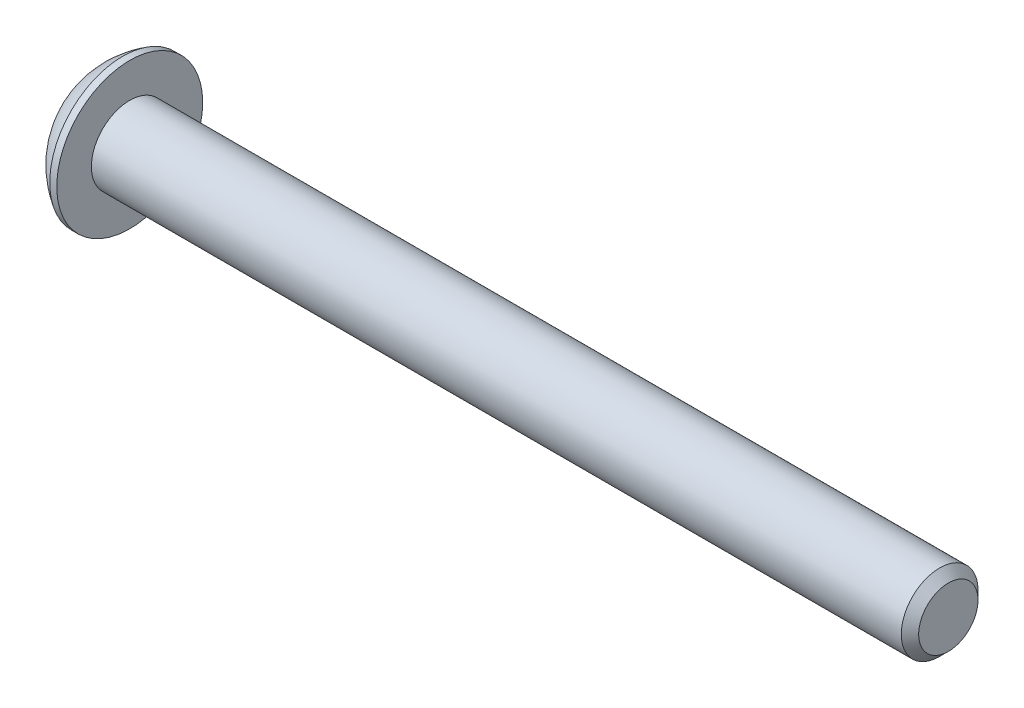
ISO-10303-21;
HEADER;
FILE_DESCRIPTION(('STEP AP214'),'2;1');
FILE_NAME('part.step','',(''),(''),'','','');
FILE_SCHEMA(('AUTOMOTIVE_DESIGN { 1 0 10303 214 1 1 1 1 }'));
ENDSEC;
DATA;
#1=APPLICATION_CONTEXT('core data for automotive mechanical design processes');
#2=APPLICATION_PROTOCOL_DEFINITION('international standard','automotive_design',2000,#1);
#3=PRODUCT_CONTEXT('',#1,'mechanical');
#4=PRODUCT('Part','Part','',(#3));
#5=PRODUCT_RELATED_PRODUCT_CATEGORY('part','',(#4));
#6=PRODUCT_DEFINITION_FORMATION('','',#4);
#7=PRODUCT_DEFINITION_CONTEXT('part definition',#1,'design');
#8=PRODUCT_DEFINITION('design','',#6,#7);
#9=PRODUCT_DEFINITION_SHAPE('','',#8);
#10=(LENGTH_UNIT() NAMED_UNIT(*) SI_UNIT(.MILLI.,.METRE.));
#11=(NAMED_UNIT(*) PLANE_ANGLE_UNIT() SI_UNIT($,.RADIAN.));
#12=(NAMED_UNIT(*) SI_UNIT($,.STERADIAN.) SOLID_ANGLE_UNIT());
#13=UNCERTAINTY_MEASURE_WITH_UNIT(LENGTH_MEASURE(1.E-05),#10,'distance_accuracy_value','');
#14=(GEOMETRIC_REPRESENTATION_CONTEXT(3) GLOBAL_UNCERTAINTY_ASSIGNED_CONTEXT((#13)) GLOBAL_UNIT_ASSIGNED_CONTEXT((#10,
#11,#12)) REPRESENTATION_CONTEXT('',''));
#15=CARTESIAN_POINT('',(0.,0.,0.));
#16=DIRECTION('',(0.,0.,1.));
#17=DIRECTION('',(1.,0.,0.));
#18=AXIS2_PLACEMENT_3D('',#15,#16,#17);
#19=CARTESIAN_POINT('',(1.32080000000034,0.,0.));
#20=DIRECTION('',(-1.,0.,0.));
#21=DIRECTION('',(0.,0.,-1.));
#22=AXIS2_PLACEMENT_3D('',#19,#20,#21);
#23=CONICAL_SURFACE('',#22,1.1937999999998,1.04719755119608);
#24=CARTESIAN_POINT('',(2.01004075135902,0.,-4.44089209850063E-13));
#25=VERTEX_POINT('',#24);
#26=VERTEX_LOOP('',#25);
#27=FACE_BOUND('',#26,.T.);
#28=CARTESIAN_POINT('',(1.32080000000009,0.,0.));
#29=DIRECTION('',(1.,0.,0.));
#30=DIRECTION('',(0.,0.,-1.));
#31=AXIS2_PLACEMENT_3D('',#28,#29,#30);
#32=CIRCLE('',#31,1.19380000000024);
#33=CARTESIAN_POINT('',(1.32080000000004,-1.03386112703797,-0.596900000000061));
#34=VERTEX_POINT('',#33);
#35=CARTESIAN_POINT('',(1.32080000000004,0.,-1.19380000000012));
#36=VERTEX_POINT('',#35);
#37=EDGE_CURVE('E40',#34,#36,#32,.T.);
#38=ORIENTED_EDGE('',*,*,#37,.F.);
#39=CARTESIAN_POINT('',(1.32080000000009,0.,0.));
#40=DIRECTION('',(1.,0.,0.));
#41=DIRECTION('',(0.,0.,-1.));
#42=AXIS2_PLACEMENT_3D('',#39,#40,#41);
#43=CIRCLE('',#42,1.19380000000024);
#44=CARTESIAN_POINT('',(1.32080000000004,-1.03386112703797,0.596900000000061));
#45=VERTEX_POINT('',#44);
#46=EDGE_CURVE('E130',#45,#34,#43,.T.);
#47=ORIENTED_EDGE('',*,*,#46,.F.);
#48=CARTESIAN_POINT('',(1.32080000000009,0.,0.));
#49=DIRECTION('',(1.,0.,0.));
#50=DIRECTION('',(0.,0.,-1.));
#51=AXIS2_PLACEMENT_3D('',#48,#49,#50);
#52=CIRCLE('',#51,1.19380000000024);
#53=CARTESIAN_POINT('',(1.32080000000004,1.49457637585666E-12,1.19380000000012));
#54=VERTEX_POINT('',#53);
#55=EDGE_CURVE('E136',#54,#45,#52,.T.);
#56=ORIENTED_EDGE('',*,*,#55,.F.);
#57=CARTESIAN_POINT('',(1.32080000000009,0.,0.));
#58=DIRECTION('',(1.,0.,0.));
#59=DIRECTION('',(0.,0.,-1.));
#60=AXIS2_PLACEMENT_3D('',#57,#58,#59);
#61=CIRCLE('',#60,1.19380000000024);
#62=CARTESIAN_POINT('',(1.32080000000004,1.03386112703797,0.59690000000006));
#63=VERTEX_POINT('',#62);
#64=EDGE_CURVE('E150',#63,#54,#61,.T.);
#65=ORIENTED_EDGE('',*,*,#64,.F.);
#66=CARTESIAN_POINT('',(1.32080000000009,0.,0.));
#67=DIRECTION('',(1.,0.,0.));
#68=DIRECTION('',(0.,0.,-1.));
#69=AXIS2_PLACEMENT_3D('',#66,#67,#68);
#70=CIRCLE('',#69,1.19380000000024);
#71=CARTESIAN_POINT('',(1.32080000000004,1.03386112703797,-0.59690000000006));
#72=VERTEX_POINT('',#71);
#73=EDGE_CURVE('E143',#72,#63,#70,.T.);
#74=ORIENTED_EDGE('',*,*,#73,.F.);
#75=CARTESIAN_POINT('',(1.32080000000009,0.,0.));
#76=DIRECTION('',(1.,0.,0.));
#77=DIRECTION('',(0.,0.,-1.));
#78=AXIS2_PLACEMENT_3D('',#75,#76,#77);
#79=CIRCLE('',#78,1.19380000000024);
#80=EDGE_CURVE('E140',#36,#72,#79,.T.);
#81=ORIENTED_EDGE('',*,*,#80,.F.);
#82=EDGE_LOOP('',(#38,#47,#56,#65,#74,#81));
#83=FACE_BOUND('',#82,.T.);
#84=ADVANCED_FACE('F37',(#27,#83),#23,.F.);
#85=CARTESIAN_POINT('',(1.3208,-2.06772225407573,1.1938));
#86=DIRECTION('',(1.,0.,0.));
#87=DIRECTION('',(0.,0.,1.));
#88=AXIS2_PLACEMENT_3D('',#85,#86,#87);
#89=PLANE('',#88);
#90=DIRECTION('',(0.,0.5,-0.866025403784439));
#91=VECTOR('',#90,1.);
#92=CARTESIAN_POINT('',(1.3208,-1.37848150271715,0.));
#93=LINE('',#92,#91);
#94=CARTESIAN_POINT('',(1.3208,-0.689240751358575,-1.1938));
#95=VERTEX_POINT('',#94);
#96=EDGE_CURVE('E112',#95,#34,#93,.F.);
#97=ORIENTED_EDGE('',*,*,#96,.T.);
#98=ORIENTED_EDGE('',*,*,#37,.T.);
#99=DIRECTION('',(0.,1.,0.));
#100=VECTOR('',#99,1.);
#101=CARTESIAN_POINT('',(1.3208,-0.689240751358575,-1.1938));
#102=LINE('',#101,#100);
#103=EDGE_CURVE('E127',#36,#95,#102,.F.);
#104=ORIENTED_EDGE('',*,*,#103,.T.);
#105=EDGE_LOOP('',(#97,#98,#104));
#106=FACE_BOUND('',#105,.T.);
#107=ADVANCED_FACE('F124',(#106),#89,.F.);
#108=CARTESIAN_POINT('',(1.3208,-2.06772225407573,1.1938));
#109=DIRECTION('',(1.,0.,0.));
#110=DIRECTION('',(0.,0.,1.));
#111=AXIS2_PLACEMENT_3D('',#108,#109,#110);
#112=PLANE('',#111);
#113=DIRECTION('',(0.,-0.5,-0.866025403784439));
#114=VECTOR('',#113,1.);
#115=CARTESIAN_POINT('',(1.3208,-0.689240751358575,1.1938));
#116=LINE('',#115,#114);
#117=CARTESIAN_POINT('',(1.3208,-1.37848150271715,0.));
#118=VERTEX_POINT('',#117);
#119=EDGE_CURVE('E132',#118,#45,#116,.F.);
#120=ORIENTED_EDGE('',*,*,#119,.T.);
#121=ORIENTED_EDGE('',*,*,#46,.T.);
#122=DIRECTION('',(0.,0.5,-0.866025403784439));
#123=VECTOR('',#122,1.);
#124=CARTESIAN_POINT('',(1.3208,-1.37848150271715,0.));
#125=LINE('',#124,#123);
#126=EDGE_CURVE('E107',#34,#118,#125,.F.);
#127=ORIENTED_EDGE('',*,*,#126,.T.);
#128=EDGE_LOOP('',(#120,#121,#127));
#129=FACE_BOUND('',#128,.T.);
#130=ADVANCED_FACE('F131',(#129),#112,.F.);
#131=CARTESIAN_POINT('',(1.3208,-2.06772225407573,1.1938));
#132=DIRECTION('',(1.,0.,0.));
#133=DIRECTION('',(0.,0.,1.));
#134=AXIS2_PLACEMENT_3D('',#131,#132,#133);
#135=PLANE('',#134);
#136=DIRECTION('',(0.,1.,0.));
#137=VECTOR('',#136,1.);
#138=CARTESIAN_POINT('',(1.3208,0.689240751358575,1.1938));
#139=LINE('',#138,#137);
#140=CARTESIAN_POINT('',(1.3208,-0.689240751358575,1.1938));
#141=VERTEX_POINT('',#140);
#142=EDGE_CURVE('E168',#141,#54,#139,.T.);
#143=ORIENTED_EDGE('',*,*,#142,.T.);
#144=ORIENTED_EDGE('',*,*,#55,.T.);
#145=DIRECTION('',(0.,-0.5,-0.866025403784439));
#146=VECTOR('',#145,1.);
#147=CARTESIAN_POINT('',(1.3208,-0.689240751358575,1.1938));
#148=LINE('',#147,#146);
#149=EDGE_CURVE('E166',#45,#141,#148,.F.);
#150=ORIENTED_EDGE('',*,*,#149,.T.);
#151=EDGE_LOOP('',(#143,#144,#150));
#152=FACE_BOUND('',#151,.T.);
#153=ADVANCED_FACE('F165',(#152),#135,.F.);
#154=CARTESIAN_POINT('',(1.3208,-2.06772225407573,1.1938));
#155=DIRECTION('',(1.,0.,0.));
#156=DIRECTION('',(0.,0.,1.));
#157=AXIS2_PLACEMENT_3D('',#154,#155,#156);
#158=PLANE('',#157);
#159=DIRECTION('',(0.,-0.499999999999999,0.866025403784439));
#160=VECTOR('',#159,1.);
#161=CARTESIAN_POINT('',(1.3208,1.37848150271715,0.));
#162=LINE('',#161,#160);
#163=CARTESIAN_POINT('',(1.3208,0.689240751358575,1.1938));
#164=VERTEX_POINT('',#163);
#165=EDGE_CURVE('E175',#164,#63,#162,.F.);
#166=ORIENTED_EDGE('',*,*,#165,.T.);
#167=ORIENTED_EDGE('',*,*,#64,.T.);
#168=DIRECTION('',(0.,1.,0.));
#169=VECTOR('',#168,1.);
#170=CARTESIAN_POINT('',(1.3208,0.689240751358575,1.1938));
#171=LINE('',#170,#169);
#172=EDGE_CURVE('E173',#54,#164,#171,.T.);
#173=ORIENTED_EDGE('',*,*,#172,.T.);
#174=EDGE_LOOP('',(#166,#167,#173));
#175=FACE_BOUND('',#174,.T.);
#176=ADVANCED_FACE('F172',(#175),#158,.F.);
#177=CARTESIAN_POINT('',(1.3208,-2.06772225407573,1.1938));
#178=DIRECTION('',(1.,0.,0.));
#179=DIRECTION('',(0.,0.,1.));
#180=AXIS2_PLACEMENT_3D('',#177,#178,#179);
#181=PLANE('',#180);
#182=DIRECTION('',(0.,0.499999999999999,0.866025403784439));
#183=VECTOR('',#182,1.);
#184=CARTESIAN_POINT('',(1.3208,0.689240751358575,-1.1938));
#185=LINE('',#184,#183);
#186=CARTESIAN_POINT('',(1.3208,1.37848150271715,0.));
#187=VERTEX_POINT('',#186);
#188=EDGE_CURVE('E186',#187,#72,#185,.F.);
#189=ORIENTED_EDGE('',*,*,#188,.T.);
#190=ORIENTED_EDGE('',*,*,#73,.T.);
#191=DIRECTION('',(0.,-0.499999999999999,0.866025403784439));
#192=VECTOR('',#191,1.);
#193=CARTESIAN_POINT('',(1.3208,1.37848150271715,0.));
#194=LINE('',#193,#192);
#195=EDGE_CURVE('E178',#63,#187,#194,.F.);
#196=ORIENTED_EDGE('',*,*,#195,.T.);
#197=EDGE_LOOP('',(#189,#190,#196));
#198=FACE_BOUND('',#197,.T.);
#199=ADVANCED_FACE('F184',(#198),#181,.F.);
#200=CARTESIAN_POINT('',(1.3208,-2.06772225407573,1.1938));
#201=DIRECTION('',(1.,0.,0.));
#202=DIRECTION('',(0.,0.,1.));
#203=AXIS2_PLACEMENT_3D('',#200,#201,#202);
#204=PLANE('',#203);
#205=DIRECTION('',(0.,1.,0.));
#206=VECTOR('',#205,1.);
#207=CARTESIAN_POINT('',(1.3208,-0.689240751358575,-1.1938));
#208=LINE('',#207,#206);
#209=CARTESIAN_POINT('',(1.3208,0.689240751358575,-1.1938));
#210=VERTEX_POINT('',#209);
#211=EDGE_CURVE('E147',#210,#36,#208,.F.);
#212=ORIENTED_EDGE('',*,*,#211,.T.);
#213=ORIENTED_EDGE('',*,*,#80,.T.);
#214=DIRECTION('',(0.,0.499999999999999,0.866025403784439));
#215=VECTOR('',#214,1.);
#216=CARTESIAN_POINT('',(1.3208,0.689240751358575,-1.1938));
#217=LINE('',#216,#215);
#218=EDGE_CURVE('E188',#72,#210,#217,.F.);
#219=ORIENTED_EDGE('',*,*,#218,.T.);
#220=EDGE_LOOP('',(#212,#213,#219));
#221=FACE_BOUND('',#220,.T.);
#222=ADVANCED_FACE('F309',(#221),#204,.F.);
#223=CARTESIAN_POINT('',(1.3208,-0.689240751358575,-1.1938));
#224=DIRECTION('',(0.,0.,1.));
#225=DIRECTION('',(0.,1.,0.));
#226=AXIS2_PLACEMENT_3D('',#223,#224,#225);
#227=PLANE('',#226);
#228=DIRECTION('',(0.,1.,0.));
#229=VECTOR('',#228,1.);
#230=CARTESIAN_POINT('',(0.,0.,-1.1938));
#231=LINE('',#230,#229);
#232=CARTESIAN_POINT('',(0.,0.689240751358575,-1.1938));
#233=VERTEX_POINT('',#232);
#234=CARTESIAN_POINT('',(0.,-0.689240751358575,-1.1938));
#235=VERTEX_POINT('',#234);
#236=EDGE_CURVE('E196',#233,#235,#231,.F.);
#237=ORIENTED_EDGE('',*,*,#236,.T.);
#238=DIRECTION('',(1.,0.,0.));
#239=VECTOR('',#238,1.);
#240=CARTESIAN_POINT('',(1.3208,-0.689240751358575,-1.1938));
#241=LINE('',#240,#239);
#242=EDGE_CURVE('E119',#235,#95,#241,.T.);
#243=ORIENTED_EDGE('',*,*,#242,.T.);
#244=ORIENTED_EDGE('',*,*,#103,.F.);
#245=ORIENTED_EDGE('',*,*,#211,.F.);
#246=DIRECTION('',(1.,0.,0.));
#247=VECTOR('',#246,1.);
#248=CARTESIAN_POINT('',(1.3208,0.689240751358575,-1.1938));
#249=LINE('',#248,#247);
#250=EDGE_CURVE('E191',#210,#233,#249,.F.);
#251=ORIENTED_EDGE('',*,*,#250,.T.);
#252=EDGE_LOOP('',(#237,#243,#244,#245,#251));
#253=FACE_BOUND('',#252,.T.);
#254=ADVANCED_FACE('F275',(#253),#227,.T.);
#255=CARTESIAN_POINT('',(1.3208,-1.37848150271715,0.));
#256=DIRECTION('',(0.,0.866025403784439,0.5));
#257=DIRECTION('',(0.,0.5,-0.866025403784439));
#258=AXIS2_PLACEMENT_3D('',#255,#256,#257);
#259=PLANE('',#258);
#260=DIRECTION('',(0.,-0.5,0.866025403784439));
#261=VECTOR('',#260,1.);
#262=CARTESIAN_POINT('',(0.,-0.689240751358575,-1.1938));
#263=LINE('',#262,#261);
#264=CARTESIAN_POINT('',(0.,-1.37848150271715,0.));
#265=VERTEX_POINT('',#264);
#266=EDGE_CURVE('E272',#235,#265,#263,.T.);
#267=ORIENTED_EDGE('',*,*,#266,.T.);
#268=DIRECTION('',(1.,0.,0.));
#269=VECTOR('',#268,1.);
#270=CARTESIAN_POINT('',(1.3208,-1.37848150271715,0.));
#271=LINE('',#270,#269);
#272=EDGE_CURVE('E114',#265,#118,#271,.T.);
#273=ORIENTED_EDGE('',*,*,#272,.T.);
#274=ORIENTED_EDGE('',*,*,#126,.F.);
#275=ORIENTED_EDGE('',*,*,#96,.F.);
#276=ORIENTED_EDGE('',*,*,#242,.F.);
#277=EDGE_LOOP('',(#267,#273,#274,#275,#276));
#278=FACE_BOUND('',#277,.T.);
#279=ADVANCED_FACE('F110',(#278),#259,.T.);
#280=CARTESIAN_POINT('',(1.3208,-0.689240751358575,1.1938));
#281=DIRECTION('',(0.,0.866025403784439,-0.5));
#282=DIRECTION('',(0.,-0.5,-0.866025403784439));
#283=AXIS2_PLACEMENT_3D('',#280,#281,#282);
#284=PLANE('',#283);
#285=DIRECTION('',(0.,0.5,0.866025403784439));
#286=VECTOR('',#285,1.);
#287=CARTESIAN_POINT('',(0.,-1.37848150271715,0.));
#288=LINE('',#287,#286);
#289=CARTESIAN_POINT('',(0.,-0.689240751358575,1.1938));
#290=VERTEX_POINT('',#289);
#291=EDGE_CURVE('E270',#265,#290,#288,.T.);
#292=ORIENTED_EDGE('',*,*,#291,.T.);
#293=DIRECTION('',(1.,0.,0.));
#294=VECTOR('',#293,1.);
#295=CARTESIAN_POINT('',(1.3208,-0.689240751358575,1.1938));
#296=LINE('',#295,#294);
#297=EDGE_CURVE('E179',#290,#141,#296,.T.);
#298=ORIENTED_EDGE('',*,*,#297,.T.);
#299=ORIENTED_EDGE('',*,*,#149,.F.);
#300=ORIENTED_EDGE('',*,*,#119,.F.);
#301=ORIENTED_EDGE('',*,*,#272,.F.);
#302=EDGE_LOOP('',(#292,#298,#299,#300,#301));
#303=FACE_BOUND('',#302,.T.);
#304=ADVANCED_FACE('F280',(#303),#284,.T.);
#305=CARTESIAN_POINT('',(1.3208,0.689240751358575,1.1938));
#306=DIRECTION('',(0.,0.,-1.));
#307=DIRECTION('',(1.,0.,0.));
#308=AXIS2_PLACEMENT_3D('',#305,#306,#307);
#309=PLANE('',#308);
#310=DIRECTION('',(0.,1.,0.));
#311=VECTOR('',#310,1.);
#312=CARTESIAN_POINT('',(0.,0.,1.1938));
#313=LINE('',#312,#311);
#314=CARTESIAN_POINT('',(0.,0.689240751358575,1.1938));
#315=VERTEX_POINT('',#314);
#316=EDGE_CURVE('E262',#290,#315,#313,.T.);
#317=ORIENTED_EDGE('',*,*,#316,.T.);
#318=DIRECTION('',(1.,0.,0.));
#319=VECTOR('',#318,1.);
#320=CARTESIAN_POINT('',(1.3208,0.689240751358575,1.1938));
#321=LINE('',#320,#319);
#322=EDGE_CURVE('E189',#315,#164,#321,.T.);
#323=ORIENTED_EDGE('',*,*,#322,.T.);
#324=ORIENTED_EDGE('',*,*,#172,.F.);
#325=ORIENTED_EDGE('',*,*,#142,.F.);
#326=ORIENTED_EDGE('',*,*,#297,.F.);
#327=EDGE_LOOP('',(#317,#323,#324,#325,#326));
#328=FACE_BOUND('',#327,.T.);
#329=ADVANCED_FACE('F282',(#328),#309,.T.);
#330=CARTESIAN_POINT('',(1.3208,1.37848150271715,0.));
#331=DIRECTION('',(0.,-0.866025403784439,-0.499999999999999));
#332=DIRECTION('',(0.,-0.499999999999999,0.866025403784439));
#333=AXIS2_PLACEMENT_3D('',#330,#331,#332);
#334=PLANE('',#333);
#335=DIRECTION('',(0.,0.499999999999999,-0.866025403784439));
#336=VECTOR('',#335,1.);
#337=CARTESIAN_POINT('',(0.,0.689240751358575,1.1938));
#338=LINE('',#337,#336);
#339=CARTESIAN_POINT('',(0.,1.37848150271715,0.));
#340=VERTEX_POINT('',#339);
#341=EDGE_CURVE('E259',#315,#340,#338,.T.);
#342=ORIENTED_EDGE('',*,*,#341,.T.);
#343=DIRECTION('',(1.,0.,0.));
#344=VECTOR('',#343,1.);
#345=CARTESIAN_POINT('',(1.3208,1.37848150271715,0.));
#346=LINE('',#345,#344);
#347=EDGE_CURVE('E204',#340,#187,#346,.T.);
#348=ORIENTED_EDGE('',*,*,#347,.T.);
#349=ORIENTED_EDGE('',*,*,#195,.F.);
#350=ORIENTED_EDGE('',*,*,#165,.F.);
#351=ORIENTED_EDGE('',*,*,#322,.F.);
#352=EDGE_LOOP('',(#342,#348,#349,#350,#351));
#353=FACE_BOUND('',#352,.T.);
#354=ADVANCED_FACE('F283',(#353),#334,.T.);
#355=CARTESIAN_POINT('',(1.3208,0.689240751358575,-1.1938));
#356=DIRECTION('',(0.,-0.866025403784439,0.499999999999999));
#357=DIRECTION('',(0.,0.499999999999999,0.866025403784439));
#358=AXIS2_PLACEMENT_3D('',#355,#356,#357);
#359=PLANE('',#358);
#360=DIRECTION('',(0.,-0.499999999999999,-0.866025403784439));
#361=VECTOR('',#360,1.);
#362=CARTESIAN_POINT('',(0.,1.37848150271715,0.));
#363=LINE('',#362,#361);
#364=EDGE_CURVE('E55',#340,#233,#363,.T.);
#365=ORIENTED_EDGE('',*,*,#364,.T.);
#366=ORIENTED_EDGE('',*,*,#250,.F.);
#367=ORIENTED_EDGE('',*,*,#218,.F.);
#368=ORIENTED_EDGE('',*,*,#188,.F.);
#369=ORIENTED_EDGE('',*,*,#347,.F.);
#370=EDGE_LOOP('',(#365,#366,#367,#368,#369));
#371=FACE_BOUND('',#370,.T.);
#372=ADVANCED_FACE('F284',(#371),#359,.T.);
#373=CARTESIAN_POINT('',(0.,0.,0.));
#374=DIRECTION('',(-1.,0.,0.));
#375=DIRECTION('',(0.,0.,-1.));
#376=AXIS2_PLACEMENT_3D('',#373,#374,#375);
#377=PLANE('',#376);
#378=ORIENTED_EDGE('',*,*,#341,.F.);
#379=ORIENTED_EDGE('',*,*,#316,.F.);
#380=ORIENTED_EDGE('',*,*,#291,.F.);
#381=ORIENTED_EDGE('',*,*,#266,.F.);
#382=ORIENTED_EDGE('',*,*,#236,.F.);
#383=ORIENTED_EDGE('',*,*,#364,.F.);
#384=EDGE_LOOP('',(#378,#379,#380,#381,#382,#383));
#385=FACE_BOUND('',#384,.T.);
#386=CARTESIAN_POINT('',(0.,1.9812,0.));
#387=CARTESIAN_POINT('',(0.,1.9811996664299,-0.0556258831179427));
#388=CARTESIAN_POINT('',(0.,1.97885520380442,-0.111261989398606));
#389=CARTESIAN_POINT('',(0.,1.96949260169541,-0.222149719830457));
#390=CARTESIAN_POINT('',(0.,1.96247308239605,-0.277401225602895));
#391=CARTESIAN_POINT('',(0.,1.94379192841038,-0.387209508139748));
#392=CARTESIAN_POINT('',(-1.85684713606366E-13,1.93212292489526,-0.441765039546365));
#393=CARTESIAN_POINT('',(1.86703426467969E-13,1.90422331175315,-0.549729449347493));
#394=CARTESIAN_POINT('',(6.95912300261454E-13,1.88798900035338,-0.60313735920887));
#395=CARTESIAN_POINT('',(1.15748432216766E-12,1.83266214476501,-0.760839131321829));
#396=CARTESIAN_POINT('',(0.,1.78690023648845,-0.86287643357543));
#397=CARTESIAN_POINT('',(0.,1.67887358150667,-1.05780719540872));
#398=CARTESIAN_POINT('',(9.54133844997183E-13,1.6166082074585,-1.15070030720801));
#399=CARTESIAN_POINT('',(5.94835315740768E-13,1.51224157140982,-1.28116890915698));
#400=CARTESIAN_POINT('',(1.63152335675163E-13,1.4755970394354,-1.32320451127027));
#401=CARTESIAN_POINT('',(-1.62128088646011E-13,1.39893832619713,-1.40400288695709));
#402=CARTESIAN_POINT('',(0.,1.35892742784699,-1.44276877695455));
#403=CARTESIAN_POINT('',(1.13752532132066E-13,1.23416504602197,-1.55382272417904));
#404=CARTESIAN_POINT('',(0.,1.14466125559859,-1.62089527952111));
#405=CARTESIAN_POINT('',(0.,0.95571214417816,-1.73902218081179));
#406=CARTESIAN_POINT('',(0.,0.856267198233559,-1.79007713076007));
#407=CARTESIAN_POINT('',(0.,0.650206345910839,-1.87477637530954));
#408=CARTESIAN_POINT('',(0.,0.543590516134851,-1.90842085586267));
#409=CARTESIAN_POINT('',(0.,0.326226155292014,-1.95733039300656));
#410=CARTESIAN_POINT('',(0.,0.215477602157926,-1.97259535144288));
#411=CARTESIAN_POINT('',(0.,-0.00701040587545037,-1.98431697865418));
#412=CARTESIAN_POINT('',(0.,-0.118749860774738,-1.98077364742917));
#413=CARTESIAN_POINT('',(0.,-0.34005017835549,-1.95497485623825));
#414=CARTESIAN_POINT('',(0.,-0.44961105266826,-1.93271949620218));
#415=CARTESIAN_POINT('',(0.,-0.663431110729179,-1.87014138774524));
#416=CARTESIAN_POINT('',(0.,-0.767690237838526,-1.82981844635272));
#417=CARTESIAN_POINT('',(0.,-0.968005760719351,-1.73219968377097));
#418=CARTESIAN_POINT('',(0.,-1.0640618469811,-1.6749032225164));
#419=CARTESIAN_POINT('',(0.,-1.19980276751284,-1.57757371205873));
#420=CARTESIAN_POINT('',(0.,-1.24366557129214,-1.54322665019466));
#421=CARTESIAN_POINT('',(0.,-1.32838995706696,-1.47093063174264));
#422=CARTESIAN_POINT('',(0.,-1.36924860178707,-1.4329782310244));
#423=CARTESIAN_POINT('',(0.,-1.48674671849224,-1.31419842051173));
#424=CARTESIAN_POINT('',(0.,-1.55842832343238,-1.22836221289311));
#425=CARTESIAN_POINT('',(0.,-1.6863396856475,-1.04586168272493));
#426=CARTESIAN_POINT('',(0.,-1.74257003024881,-0.949197771949777));
#427=CARTESIAN_POINT('',(0.,-1.81416142504011,-0.798182600298686));
#428=CARTESIAN_POINT('',(0.,-1.83591780585876,-0.746776203847793));
#429=CARTESIAN_POINT('',(0.,-1.87500754181093,-0.642341081688637));
#430=CARTESIAN_POINT('',(0.,-1.89234447645405,-0.589313708122847));
#431=CARTESIAN_POINT('',(0.,-1.92246053433555,-0.482076273028395));
#432=CARTESIAN_POINT('',(0.,-1.93524685475119,-0.42786822425751));
#433=CARTESIAN_POINT('',(0.,-1.95620937250495,-0.318578151844612));
#434=CARTESIAN_POINT('',(0.,-1.96438692958148,-0.263496390912872));
#435=CARTESIAN_POINT('',(0.,-1.97388528284654,-0.173607715038558));
#436=CARTESIAN_POINT('',(0.,-1.97662743364427,-0.138944718024998));
#437=CARTESIAN_POINT('',(0.,-1.98028489645284,-0.0695224782567004));
#438=CARTESIAN_POINT('',(0.,-1.98120020846368,-0.0347632355019632));
#439=CARTESIAN_POINT('',(0.,-1.98119966642991,0.0556258831179438));
#440=CARTESIAN_POINT('',(0.,-1.97885520380443,0.111261989398607));
#441=CARTESIAN_POINT('',(0.,-1.96949260169542,0.222149719830459));
#442=CARTESIAN_POINT('',(0.,-1.96247308239606,0.277401225602896));
#443=CARTESIAN_POINT('',(0.,-1.94379192841039,0.387209508139749));
#444=CARTESIAN_POINT('',(-1.85663518818529E-13,-1.93212292489527,0.441765039546367));
#445=CARTESIAN_POINT('',(1.86682214444571E-13,-1.90422331175316,0.549729449347494));
#446=CARTESIAN_POINT('',(6.95851299742614E-13,-1.88798900035339,0.603137359208871));
#447=CARTESIAN_POINT('',(1.15760603242308E-12,-1.83266214476502,0.76083913132183));
#448=CARTESIAN_POINT('',(0.,-1.78690023648846,0.862876433575432));
#449=CARTESIAN_POINT('',(0.,-1.67887358150668,1.05780719540872));
#450=CARTESIAN_POINT('',(9.51676789209376E-13,-1.61660820745851,1.15070030720801));
#451=CARTESIAN_POINT('',(5.93462231683297E-13,-1.51224157140983,1.28116890915698));
#452=CARTESIAN_POINT('',(1.62776229463016E-13,-1.4755970394354,1.32320451127027));
#453=CARTESIAN_POINT('',(-1.61752345056899E-13,-1.39893832619714,1.40400288695709));
#454=CARTESIAN_POINT('',(0.,-1.35892742784699,1.44276877695455));
#455=CARTESIAN_POINT('',(1.13488992312735E-13,-1.23416504602198,1.55382272417904));
#456=CARTESIAN_POINT('',(0.,-1.1446612555986,1.62089527952111));
#457=CARTESIAN_POINT('',(0.,-0.955712144178172,1.7390221808118));
#458=CARTESIAN_POINT('',(0.,-0.85626719823357,1.79007713076008));
#459=CARTESIAN_POINT('',(0.,-0.650206345910848,1.87477637530954));
#460=CARTESIAN_POINT('',(0.,-0.54359051613486,1.90842085586267));
#461=CARTESIAN_POINT('',(0.,-0.326226155292023,1.95733039300656));
#462=CARTESIAN_POINT('',(0.,-0.215477602157935,1.97259535144288));
#463=CARTESIAN_POINT('',(0.,0.00701040587544159,1.98431697865418));
#464=CARTESIAN_POINT('',(0.,0.118749860774729,1.98077364742916));
#465=CARTESIAN_POINT('',(0.,0.340050178355481,1.95497485623824));
#466=CARTESIAN_POINT('',(0.,0.449611052668251,1.93271949620218));
#467=CARTESIAN_POINT('',(0.,0.663431110729171,1.87014138774524));
#468=CARTESIAN_POINT('',(0.,0.767690237838518,1.82981844635273));
#469=CARTESIAN_POINT('',(0.,0.968005760719342,1.73219968377097));
#470=CARTESIAN_POINT('',(0.,1.06406184698109,1.6749032225164));
#471=CARTESIAN_POINT('',(0.,1.19980276751283,1.57757371205873));
#472=CARTESIAN_POINT('',(0.,1.24366557129213,1.54322665019466));
#473=CARTESIAN_POINT('',(0.,1.32838995706696,1.47093063174264));
#474=CARTESIAN_POINT('',(0.,1.36924860178706,1.4329782310244));
#475=CARTESIAN_POINT('',(0.,1.48674671849222,1.31419842051173));
#476=CARTESIAN_POINT('',(0.,1.55842832343237,1.22836221289311));
#477=CARTESIAN_POINT('',(0.,1.6863396856475,1.04586168272493));
#478=CARTESIAN_POINT('',(0.,1.74257003024879,0.949197771949774));
#479=CARTESIAN_POINT('',(0.,1.8141614250401,0.798182600298684));
#480=CARTESIAN_POINT('',(0.,1.83591780585875,0.746776203847791));
#481=CARTESIAN_POINT('',(0.,1.87500754181092,0.642341081688635));
#482=CARTESIAN_POINT('',(0.,1.89234447645403,0.589313708122846));
#483=CARTESIAN_POINT('',(0.,1.92246053433554,0.482076273028394));
#484=CARTESIAN_POINT('',(0.,1.93524685475117,0.427868224257509));
#485=CARTESIAN_POINT('',(0.,1.95620937250493,0.318578151844611));
#486=CARTESIAN_POINT('',(0.,1.96438692958147,0.263496390912871));
#487=CARTESIAN_POINT('',(0.,1.97388528284653,0.173607715038558));
#488=CARTESIAN_POINT('',(0.,1.97662743364426,0.138944718024998));
#489=CARTESIAN_POINT('',(0.,1.98028489645283,0.0695224782567008));
#490=CARTESIAN_POINT('',(0.,1.98120020846367,0.0347632355019639));
#491=CARTESIAN_POINT('',(0.,1.9812,0.));
#492=B_SPLINE_CURVE_WITH_KNOTS('',3,(#386,#387,#388,#389,#390,#391,#392,#393,#394,#395,#396,
#397,#398,#399,#400,#401,#402,#403,#404,#405,#406,#407,#408,#409,#410,#411,#412,#413,#414,#415,
#416,#417,#418,#419,#420,#421,#422,#423,#424,#425,#426,#427,#428,#429,#430,#431,#432,#433,#434,
#435,#436,#437,#438,#439,#440,#441,#442,#443,#444,#445,#446,#447,#448,#449,#450,#451,#452,#453,
#454,#455,#456,#457,#458,#459,#460,#461,#462,#463,#464,#465,#466,#467,#468,#469,#470,#471,#472,
#473,#474,#475,#476,#477,#478,#479,#480,#481,#482,#483,#484,#485,#486,#487,#488,#489,#490,#491),
.UNSPECIFIED.,.T.,.F.,(4,2,2,2,2,2,2,2,2,2,2,2,2,2,2,2,2,2,2,2,2,2,2,2,2,2,2,2,2,2,2,2,2,2,2,2,
2,2,2,2,2,2,2,2,2,2,2,2,2,2,2,2,4),(0.,0.166845646007828,0.333740557374255,0.500901034367693,
0.668197445942387,1.00199278686282,1.33580081809885,1.50292354032982,1.6698851310853,
2.00370118900129,2.33750465770544,2.6713045611591,3.00510624723801,3.33890793331696,
3.67270783677065,4.00651130547476,4.34032736339027,4.50728895414555,4.67441167637632,
5.0082197076126,5.34201504853333,5.50931146010828,5.67647193710192,5.84336684846845,
6.01021249447641,6.11448220058335,6.2187519066903,6.38559755269813,6.55249246406455,
6.71965294105799,6.88694935263268,7.22074469355312,7.55455272478915,7.72167544702012,
7.8886370377756,8.22245309569159,8.55625656439574,8.89005646784939,9.22385815392831,
9.55765984000726,9.89145974346095,10.2252632121651,10.5590792700806,10.7260408608358,
10.8931635830666,11.2269716143029,11.5607669552236,11.7280633667986,11.8952238437922,
12.0621187551587,12.2289644011667,12.3332341072736,12.4375038133806),.UNSPECIFIED.);
#493=CARTESIAN_POINT('',(0.,1.9812,0.));
#494=VERTEX_POINT('',#493);
#495=EDGE_CURVE('E153',#494,#494,#492,.T.);
#496=ORIENTED_EDGE('',*,*,#495,.T.);
#497=EDGE_LOOP('',(#496));
#498=FACE_BOUND('',#497,.T.);
#499=ADVANCED_FACE('F277',(#385,#498),#377,.T.);
#500=CARTESIAN_POINT('',(4.13385000000001,0.,0.));
#501=DIRECTION('',(0.,1.,0.));
#502=DIRECTION('',(1.,0.,0.));
#503=AXIS2_PLACEMENT_3D('',#500,#501,#502);
#504=SPHERICAL_SURFACE('',#503,4.5840887057844);
#505=CARTESIAN_POINT('',(1.8288,0.,0.));
#506=DIRECTION('',(1.,0.,0.));
#507=DIRECTION('',(0.,0.,-1.));
#508=AXIS2_PLACEMENT_3D('',#505,#506,#507);
#509=CIRCLE('',#508,3.9624);
#510=CARTESIAN_POINT('',(1.8288,0.,-3.9624));
#511=VERTEX_POINT('',#510);
#512=EDGE_CURVE('E252',#511,#511,#509,.F.);
#513=ORIENTED_EDGE('',*,*,#512,.T.);
#514=EDGE_LOOP('',(#513));
#515=FACE_BOUND('',#514,.T.);
#516=ORIENTED_EDGE('',*,*,#495,.F.);
#517=EDGE_LOOP('',(#516));
#518=FACE_BOUND('',#517,.T.);
#519=ADVANCED_FACE('F291',(#515,#518),#504,.T.);
#520=CARTESIAN_POINT('',(46.6598,0.,0.));
#521=DIRECTION('',(-1.,0.,0.));
#522=DIRECTION('',(0.,0.,-1.));
#523=AXIS2_PLACEMENT_3D('',#520,#521,#522);
#524=PLANE('',#523);
#525=CARTESIAN_POINT('',(46.6597999999294,0.,0.));
#526=DIRECTION('',(1.,0.,0.));
#527=DIRECTION('',(0.,0.,-1.));
#528=AXIS2_PLACEMENT_3D('',#525,#526,#527);
#529=CIRCLE('',#528,1.61036000002923);
#530=CARTESIAN_POINT('',(46.6597999999294,0.,-1.61036000002923));
#531=VERTEX_POINT('',#530);
#532=EDGE_CURVE('E250',#531,#531,#529,.T.);
#533=ORIENTED_EDGE('',*,*,#532,.T.);
#534=EDGE_LOOP('',(#533));
#535=FACE_BOUND('',#534,.T.);
#536=ADVANCED_FACE('F346',(#535),#524,.F.);
#537=CARTESIAN_POINT('',(0.,0.,0.));
#538=DIRECTION('',(-1.,0.,0.));
#539=DIRECTION('',(0.,0.,-1.));
#540=AXIS2_PLACEMENT_3D('',#537,#538,#539);
#541=CYLINDRICAL_SURFACE('',#540,3.9624);
#542=ORIENTED_EDGE('',*,*,#512,.F.);
#543=EDGE_LOOP('',(#542));
#544=FACE_BOUND('',#543,.T.);
#545=CARTESIAN_POINT('',(2.2098,0.,0.));
#546=DIRECTION('',(1.,0.,0.));
#547=DIRECTION('',(0.,0.,-1.));
#548=AXIS2_PLACEMENT_3D('',#545,#546,#547);
#549=CIRCLE('',#548,3.9624);
#550=CARTESIAN_POINT('',(2.2098,0.,-3.9624));
#551=VERTEX_POINT('',#550);
#552=EDGE_CURVE('E247',#551,#551,#549,.T.);
#553=ORIENTED_EDGE('',*,*,#552,.F.);
#554=EDGE_LOOP('',(#553));
#555=FACE_BOUND('',#554,.T.);
#556=ADVANCED_FACE('F354',(#544,#555),#541,.T.);
#557=CARTESIAN_POINT('',(46.1873600001468,0.,0.));
#558=DIRECTION('',(-1.,0.,0.));
#559=DIRECTION('',(0.,0.,-1.));
#560=AXIS2_PLACEMENT_3D('',#557,#558,#559);
#561=CONICAL_SURFACE('',#560,2.08279999986871,0.785398163457608);
#562=CARTESIAN_POINT('',(46.18736,0.,0.));
#563=DIRECTION('',(1.,0.,0.));
#564=DIRECTION('',(0.,0.,-1.));
#565=AXIS2_PLACEMENT_3D('',#562,#563,#564);
#566=CIRCLE('',#565,2.0828);
#567=CARTESIAN_POINT('',(46.18736,0.,-2.0828));
#568=VERTEX_POINT('',#567);
#569=EDGE_CURVE('E46',#568,#568,#566,.T.);
#570=ORIENTED_EDGE('',*,*,#569,.T.);
#571=EDGE_LOOP('',(#570));
#572=FACE_BOUND('',#571,.T.);
#573=ORIENTED_EDGE('',*,*,#532,.F.);
#574=EDGE_LOOP('',(#573));
#575=FACE_BOUND('',#574,.T.);
#576=ADVANCED_FACE('F364',(#572,#575),#561,.T.);
#577=CARTESIAN_POINT('',(2.2098,2.08279999999999,0.));
#578=DIRECTION('',(-1.,0.,0.));
#579=DIRECTION('',(0.,0.,-1.));
#580=AXIS2_PLACEMENT_3D('',#577,#578,#579);
#581=PLANE('',#580);
#582=CARTESIAN_POINT('',(2.2098,0.,0.));
#583=DIRECTION('',(1.,0.,0.));
#584=DIRECTION('',(0.,0.,-1.));
#585=AXIS2_PLACEMENT_3D('',#582,#583,#584);
#586=CIRCLE('',#585,2.0828);
#587=CARTESIAN_POINT('',(2.2098,0.,-2.0828));
#588=VERTEX_POINT('',#587);
#589=EDGE_CURVE('E11',#588,#588,#586,.F.);
#590=ORIENTED_EDGE('',*,*,#589,.T.);
#591=EDGE_LOOP('',(#590));
#592=FACE_BOUND('',#591,.T.);
#593=ORIENTED_EDGE('',*,*,#552,.T.);
#594=EDGE_LOOP('',(#593));
#595=FACE_BOUND('',#594,.T.);
#596=ADVANCED_FACE('F374',(#592,#595),#581,.F.);
#597=CARTESIAN_POINT('',(0.,0.,0.));
#598=DIRECTION('',(-1.,0.,0.));
#599=DIRECTION('',(0.,0.,-1.));
#600=AXIS2_PLACEMENT_3D('',#597,#598,#599);
#601=CYLINDRICAL_SURFACE('',#600,2.0828);
#602=ORIENTED_EDGE('',*,*,#589,.F.);
#603=EDGE_LOOP('',(#602));
#604=FACE_BOUND('',#603,.T.);
#605=ORIENTED_EDGE('',*,*,#569,.F.);
#606=EDGE_LOOP('',(#605));
#607=FACE_BOUND('',#606,.T.);
#608=ADVANCED_FACE('F384',(#604,#607),#601,.T.);
#609=CLOSED_SHELL('',(#84,#107,#130,#153,#176,#199,#222,#254,#279,#304,#329,#354,#372,#499,#519,
#536,#556,#576,#596,#608));
#610=MANIFOLD_SOLID_BREP('B2',#609);
#611=ADVANCED_BREP_SHAPE_REPRESENTATION('',(#18,#610),#14);
#612=SHAPE_DEFINITION_REPRESENTATION(#9,#611);
ENDSEC;
END-ISO-10303-21;
